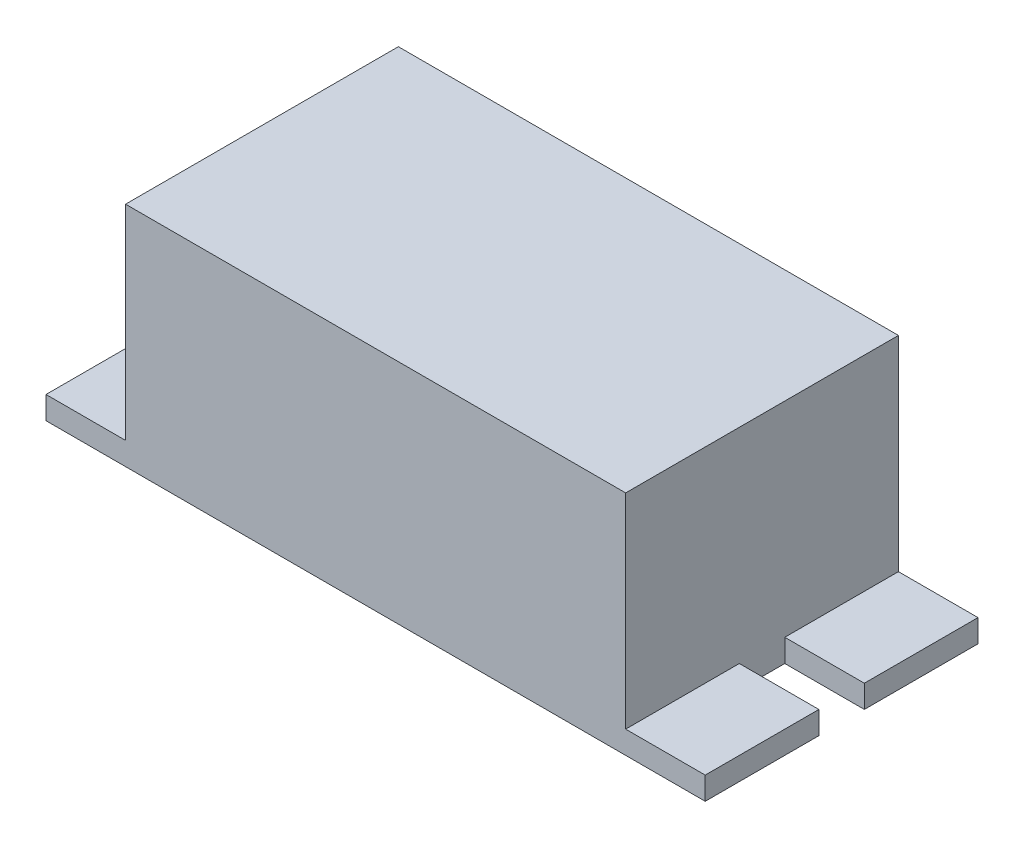
ISO-10303-21;
HEADER;
FILE_DESCRIPTION(('STEP AP214'),'2;1');
FILE_NAME('part.step','',(''),(''),'','','');
FILE_SCHEMA(('AUTOMOTIVE_DESIGN { 1 0 10303 214 1 1 1 1 }'));
ENDSEC;
DATA;
#1=APPLICATION_CONTEXT('core data for automotive mechanical design processes');
#2=APPLICATION_PROTOCOL_DEFINITION('international standard','automotive_design',2000,#1);
#3=PRODUCT_CONTEXT('',#1,'mechanical');
#4=PRODUCT('Part','Part','',(#3));
#5=PRODUCT_RELATED_PRODUCT_CATEGORY('part','',(#4));
#6=PRODUCT_DEFINITION_FORMATION('','',#4);
#7=PRODUCT_DEFINITION_CONTEXT('part definition',#1,'design');
#8=PRODUCT_DEFINITION('design','',#6,#7);
#9=PRODUCT_DEFINITION_SHAPE('','',#8);
#10=(LENGTH_UNIT() NAMED_UNIT(*) SI_UNIT(.MILLI.,.METRE.));
#11=(NAMED_UNIT(*) PLANE_ANGLE_UNIT() SI_UNIT($,.RADIAN.));
#12=(NAMED_UNIT(*) SI_UNIT($,.STERADIAN.) SOLID_ANGLE_UNIT());
#13=UNCERTAINTY_MEASURE_WITH_UNIT(LENGTH_MEASURE(1.E-05),#10,'distance_accuracy_value','');
#14=(GEOMETRIC_REPRESENTATION_CONTEXT(3) GLOBAL_UNCERTAINTY_ASSIGNED_CONTEXT((#13)) GLOBAL_UNIT_ASSIGNED_CONTEXT((#10,
#11,#12)) REPRESENTATION_CONTEXT('',''));
#15=CARTESIAN_POINT('',(0.,0.,0.));
#16=DIRECTION('',(0.,0.,1.));
#17=DIRECTION('',(1.,0.,0.));
#18=AXIS2_PLACEMENT_3D('',#15,#16,#17);
#19=CARTESIAN_POINT('',(-22.,2.,0.));
#20=DIRECTION('',(0.,1.,0.));
#21=DIRECTION('',(0.,0.,1.));
#22=AXIS2_PLACEMENT_3D('',#19,#20,#21);
#23=PLANE('',#22);
#24=DIRECTION('',(-1.,0.,0.));
#25=VECTOR('',#24,1.);
#26=CARTESIAN_POINT('',(0.,2.,-12.));
#27=LINE('',#26,#25);
#28=CARTESIAN_POINT('',(-29.,2.,-12.));
#29=VERTEX_POINT('',#28);
#30=CARTESIAN_POINT('',(-22.,2.,-12.));
#31=VERTEX_POINT('',#30);
#32=EDGE_CURVE('E176',#29,#31,#27,.F.);
#33=ORIENTED_EDGE('',*,*,#32,.F.);
#34=DIRECTION('',(0.,0.,1.));
#35=VECTOR('',#34,1.);
#36=CARTESIAN_POINT('',(-29.,2.,0.));
#37=LINE('',#36,#35);
#38=CARTESIAN_POINT('',(-29.,2.,-2.));
#39=VERTEX_POINT('',#38);
#40=EDGE_CURVE('E183',#39,#29,#37,.F.);
#41=ORIENTED_EDGE('',*,*,#40,.F.);
#42=DIRECTION('',(-1.,0.,0.));
#43=VECTOR('',#42,1.);
#44=CARTESIAN_POINT('',(-22.,2.,-2.00000000000001));
#45=LINE('',#44,#43);
#46=CARTESIAN_POINT('',(-22.,2.,-2.00000000000001));
#47=VERTEX_POINT('',#46);
#48=EDGE_CURVE('E188',#39,#47,#45,.F.);
#49=ORIENTED_EDGE('',*,*,#48,.T.);
#50=DIRECTION('',(0.,0.,1.));
#51=VECTOR('',#50,1.);
#52=CARTESIAN_POINT('',(-22.,2.,0.));
#53=LINE('',#52,#51);
#54=EDGE_CURVE('E125',#31,#47,#53,.T.);
#55=ORIENTED_EDGE('',*,*,#54,.F.);
#56=EDGE_LOOP('',(#33,#41,#49,#55));
#57=FACE_BOUND('',#56,.T.);
#58=ADVANCED_FACE('F16',(#57),#23,.T.);
#59=CARTESIAN_POINT('',(29.,2.,0.));
#60=DIRECTION('',(0.,1.,0.));
#61=DIRECTION('',(0.,0.,1.));
#62=AXIS2_PLACEMENT_3D('',#59,#60,#61);
#63=PLANE('',#62);
#64=DIRECTION('',(-1.,0.,0.));
#65=VECTOR('',#64,1.);
#66=CARTESIAN_POINT('',(0.,2.,-12.));
#67=LINE('',#66,#65);
#68=CARTESIAN_POINT('',(22.,2.,-12.));
#69=VERTEX_POINT('',#68);
#70=CARTESIAN_POINT('',(29.,2.,-12.));
#71=VERTEX_POINT('',#70);
#72=EDGE_CURVE('E171',#69,#71,#67,.F.);
#73=ORIENTED_EDGE('',*,*,#72,.F.);
#74=DIRECTION('',(0.,0.,-1.));
#75=VECTOR('',#74,1.);
#76=CARTESIAN_POINT('',(22.,2.,0.));
#77=LINE('',#76,#75);
#78=CARTESIAN_POINT('',(22.,2.,-2.00000000000001));
#79=VERTEX_POINT('',#78);
#80=EDGE_CURVE('E242',#79,#69,#77,.T.);
#81=ORIENTED_EDGE('',*,*,#80,.F.);
#82=DIRECTION('',(-1.,0.,0.));
#83=VECTOR('',#82,1.);
#84=CARTESIAN_POINT('',(29.,2.,-1.99999999999999));
#85=LINE('',#84,#83);
#86=CARTESIAN_POINT('',(29.,2.,-1.99999999999999));
#87=VERTEX_POINT('',#86);
#88=EDGE_CURVE('E245',#79,#87,#85,.F.);
#89=ORIENTED_EDGE('',*,*,#88,.T.);
#90=DIRECTION('',(0.,0.,1.));
#91=VECTOR('',#90,1.);
#92=CARTESIAN_POINT('',(29.,2.,0.));
#93=LINE('',#92,#91);
#94=EDGE_CURVE('E250',#71,#87,#93,.T.);
#95=ORIENTED_EDGE('',*,*,#94,.F.);
#96=EDGE_LOOP('',(#73,#81,#89,#95));
#97=FACE_BOUND('',#96,.T.);
#98=ADVANCED_FACE('F258',(#97),#63,.T.);
#99=CARTESIAN_POINT('',(29.,2.,0.));
#100=DIRECTION('',(0.,1.,0.));
#101=DIRECTION('',(0.,0.,1.));
#102=AXIS2_PLACEMENT_3D('',#99,#100,#101);
#103=PLANE('',#102);
#104=DIRECTION('',(1.,0.,0.));
#105=VECTOR('',#104,1.);
#106=CARTESIAN_POINT('',(0.,2.,12.));
#107=LINE('',#106,#105);
#108=CARTESIAN_POINT('',(29.,2.,12.));
#109=VERTEX_POINT('',#108);
#110=CARTESIAN_POINT('',(22.,2.,12.));
#111=VERTEX_POINT('',#110);
#112=EDGE_CURVE('E218',#109,#111,#107,.F.);
#113=ORIENTED_EDGE('',*,*,#112,.F.);
#114=DIRECTION('',(0.,0.,1.));
#115=VECTOR('',#114,1.);
#116=CARTESIAN_POINT('',(29.,2.,0.));
#117=LINE('',#116,#115);
#118=CARTESIAN_POINT('',(29.,2.,2.00000000000001));
#119=VERTEX_POINT('',#118);
#120=EDGE_CURVE('E224',#119,#109,#117,.T.);
#121=ORIENTED_EDGE('',*,*,#120,.F.);
#122=DIRECTION('',(1.,0.,0.));
#123=VECTOR('',#122,1.);
#124=CARTESIAN_POINT('',(22.,2.,1.99999999999999));
#125=LINE('',#124,#123);
#126=CARTESIAN_POINT('',(22.,2.,1.99999999999999));
#127=VERTEX_POINT('',#126);
#128=EDGE_CURVE('E229',#119,#127,#125,.F.);
#129=ORIENTED_EDGE('',*,*,#128,.T.);
#130=DIRECTION('',(0.,0.,-1.));
#131=VECTOR('',#130,1.);
#132=CARTESIAN_POINT('',(22.,2.,0.));
#133=LINE('',#132,#131);
#134=EDGE_CURVE('E237',#111,#127,#133,.T.);
#135=ORIENTED_EDGE('',*,*,#134,.F.);
#136=EDGE_LOOP('',(#113,#121,#129,#135));
#137=FACE_BOUND('',#136,.T.);
#138=ADVANCED_FACE('F290',(#137),#103,.T.);
#139=CARTESIAN_POINT('',(22.,20.,0.));
#140=DIRECTION('',(0.,1.,0.));
#141=DIRECTION('',(0.,0.,1.));
#142=AXIS2_PLACEMENT_3D('',#139,#140,#141);
#143=PLANE('',#142);
#144=DIRECTION('',(0.,0.,-1.));
#145=VECTOR('',#144,1.);
#146=CARTESIAN_POINT('',(22.,20.,0.));
#147=LINE('',#146,#145);
#148=CARTESIAN_POINT('',(22.,20.,-12.));
#149=VERTEX_POINT('',#148);
#150=CARTESIAN_POINT('',(22.,20.,12.));
#151=VERTEX_POINT('',#150);
#152=EDGE_CURVE('E167',#149,#151,#147,.F.);
#153=ORIENTED_EDGE('',*,*,#152,.F.);
#154=DIRECTION('',(-1.,0.,0.));
#155=VECTOR('',#154,1.);
#156=CARTESIAN_POINT('',(0.,20.,-12.));
#157=LINE('',#156,#155);
#158=CARTESIAN_POINT('',(-22.,20.,-12.));
#159=VERTEX_POINT('',#158);
#160=EDGE_CURVE('E165',#159,#149,#157,.F.);
#161=ORIENTED_EDGE('',*,*,#160,.F.);
#162=DIRECTION('',(0.,0.,1.));
#163=VECTOR('',#162,1.);
#164=CARTESIAN_POINT('',(-22.,20.,0.));
#165=LINE('',#164,#163);
#166=CARTESIAN_POINT('',(-22.,20.,12.));
#167=VERTEX_POINT('',#166);
#168=EDGE_CURVE('E140',#167,#159,#165,.F.);
#169=ORIENTED_EDGE('',*,*,#168,.F.);
#170=DIRECTION('',(1.,0.,0.));
#171=VECTOR('',#170,1.);
#172=CARTESIAN_POINT('',(0.,20.,12.));
#173=LINE('',#172,#171);
#174=EDGE_CURVE('E213',#151,#167,#173,.F.);
#175=ORIENTED_EDGE('',*,*,#174,.F.);
#176=EDGE_LOOP('',(#153,#161,#169,#175));
#177=FACE_BOUND('',#176,.T.);
#178=ADVANCED_FACE('F166',(#177),#143,.T.);
#179=CARTESIAN_POINT('',(-22.,2.,0.));
#180=DIRECTION('',(0.,1.,0.));
#181=DIRECTION('',(0.,0.,1.));
#182=AXIS2_PLACEMENT_3D('',#179,#180,#181);
#183=PLANE('',#182);
#184=DIRECTION('',(1.,0.,0.));
#185=VECTOR('',#184,1.);
#186=CARTESIAN_POINT('',(0.,2.,12.));
#187=LINE('',#186,#185);
#188=CARTESIAN_POINT('',(-22.,2.,12.));
#189=VERTEX_POINT('',#188);
#190=CARTESIAN_POINT('',(-29.,2.,12.));
#191=VERTEX_POINT('',#190);
#192=EDGE_CURVE('E144',#189,#191,#187,.F.);
#193=ORIENTED_EDGE('',*,*,#192,.F.);
#194=DIRECTION('',(0.,0.,1.));
#195=VECTOR('',#194,1.);
#196=CARTESIAN_POINT('',(-22.,2.,0.));
#197=LINE('',#196,#195);
#198=CARTESIAN_POINT('',(-22.,2.,1.99999999999999));
#199=VERTEX_POINT('',#198);
#200=EDGE_CURVE('E142',#199,#189,#197,.T.);
#201=ORIENTED_EDGE('',*,*,#200,.F.);
#202=DIRECTION('',(1.,0.,0.));
#203=VECTOR('',#202,1.);
#204=CARTESIAN_POINT('',(-29.,2.,2.00000000000001));
#205=LINE('',#204,#203);
#206=CARTESIAN_POINT('',(-29.,2.,2.00000000000001));
#207=VERTEX_POINT('',#206);
#208=EDGE_CURVE('E19',#199,#207,#205,.F.);
#209=ORIENTED_EDGE('',*,*,#208,.T.);
#210=DIRECTION('',(0.,0.,1.));
#211=VECTOR('',#210,1.);
#212=CARTESIAN_POINT('',(-29.,2.,0.));
#213=LINE('',#212,#211);
#214=EDGE_CURVE('E204',#191,#207,#213,.F.);
#215=ORIENTED_EDGE('',*,*,#214,.F.);
#216=EDGE_LOOP('',(#193,#201,#209,#215));
#217=FACE_BOUND('',#216,.T.);
#218=ADVANCED_FACE('F143',(#217),#183,.T.);
#219=CARTESIAN_POINT('',(-29.,0.,2.00000000000001));
#220=DIRECTION('',(0.,0.,1.));
#221=DIRECTION('',(1.,0.,0.));
#222=AXIS2_PLACEMENT_3D('',#219,#220,#221);
#223=PLANE('',#222);
#224=DIRECTION('',(0.,1.,0.));
#225=VECTOR('',#224,1.);
#226=CARTESIAN_POINT('',(-22.,20.,1.99999999999999));
#227=LINE('',#226,#225);
#228=CARTESIAN_POINT('',(-22.,0.,2.));
#229=VERTEX_POINT('',#228);
#230=EDGE_CURVE('E133',#229,#199,#227,.T.);
#231=ORIENTED_EDGE('',*,*,#230,.F.);
#232=DIRECTION('',(1.,0.,0.));
#233=VECTOR('',#232,1.);
#234=CARTESIAN_POINT('',(-29.,0.,2.00000000000001));
#235=LINE('',#234,#233);
#236=CARTESIAN_POINT('',(-29.,0.,2.00000000000001));
#237=VERTEX_POINT('',#236);
#238=EDGE_CURVE('E202',#237,#229,#235,.T.);
#239=ORIENTED_EDGE('',*,*,#238,.F.);
#240=DIRECTION('',(0.,-1.,0.));
#241=VECTOR('',#240,1.);
#242=CARTESIAN_POINT('',(-29.,2.,2.00000000000001));
#243=LINE('',#242,#241);
#244=EDGE_CURVE('E136',#207,#237,#243,.T.);
#245=ORIENTED_EDGE('',*,*,#244,.F.);
#246=ORIENTED_EDGE('',*,*,#208,.F.);
#247=EDGE_LOOP('',(#231,#239,#245,#246));
#248=FACE_BOUND('',#247,.T.);
#249=ADVANCED_FACE('F131',(#248),#223,.F.);
#250=CARTESIAN_POINT('',(-22.,20.,0.));
#251=DIRECTION('',(-1.,0.,0.));
#252=DIRECTION('',(0.,0.,1.));
#253=AXIS2_PLACEMENT_3D('',#250,#251,#252);
#254=PLANE('',#253);
#255=ORIENTED_EDGE('',*,*,#200,.T.);
#256=DIRECTION('',(0.,1.,0.));
#257=VECTOR('',#256,1.);
#258=CARTESIAN_POINT('',(-22.,10.,12.));
#259=LINE('',#258,#257);
#260=EDGE_CURVE('E160',#167,#189,#259,.F.);
#261=ORIENTED_EDGE('',*,*,#260,.F.);
#262=ORIENTED_EDGE('',*,*,#168,.T.);
#263=DIRECTION('',(0.,1.,0.));
#264=VECTOR('',#263,1.);
#265=CARTESIAN_POINT('',(-22.,10.,-12.));
#266=LINE('',#265,#264);
#267=EDGE_CURVE('E158',#31,#159,#266,.T.);
#268=ORIENTED_EDGE('',*,*,#267,.F.);
#269=ORIENTED_EDGE('',*,*,#54,.T.);
#270=DIRECTION('',(0.,1.,0.));
#271=VECTOR('',#270,1.);
#272=CARTESIAN_POINT('',(-22.,0.,-2.00000000000001));
#273=LINE('',#272,#271);
#274=CARTESIAN_POINT('',(-22.,0.,-2.00000000000001));
#275=VERTEX_POINT('',#274);
#276=EDGE_CURVE('E147',#47,#275,#273,.F.);
#277=ORIENTED_EDGE('',*,*,#276,.T.);
#278=DIRECTION('',(0.,0.,-1.));
#279=VECTOR('',#278,1.);
#280=CARTESIAN_POINT('',(-22.,0.,0.));
#281=LINE('',#280,#279);
#282=EDGE_CURVE('E151',#229,#275,#281,.T.);
#283=ORIENTED_EDGE('',*,*,#282,.F.);
#284=ORIENTED_EDGE('',*,*,#230,.T.);
#285=EDGE_LOOP('',(#255,#261,#262,#268,#269,#277,#283,#284));
#286=FACE_BOUND('',#285,.T.);
#287=ADVANCED_FACE('F149',(#286),#254,.T.);
#288=CARTESIAN_POINT('',(-22.,0.,-2.00000000000001));
#289=DIRECTION('',(0.,0.,-1.));
#290=DIRECTION('',(-1.,0.,0.));
#291=AXIS2_PLACEMENT_3D('',#288,#289,#290);
#292=PLANE('',#291);
#293=DIRECTION('',(0.,-1.,0.));
#294=VECTOR('',#293,1.);
#295=CARTESIAN_POINT('',(-29.,2.,-2.));
#296=LINE('',#295,#294);
#297=CARTESIAN_POINT('',(-29.,0.,-2.));
#298=VERTEX_POINT('',#297);
#299=EDGE_CURVE('E185',#298,#39,#296,.F.);
#300=ORIENTED_EDGE('',*,*,#299,.F.);
#301=DIRECTION('',(1.,0.,0.));
#302=VECTOR('',#301,1.);
#303=CARTESIAN_POINT('',(-29.,0.,-2.00000000000001));
#304=LINE('',#303,#302);
#305=EDGE_CURVE('E193',#275,#298,#304,.F.);
#306=ORIENTED_EDGE('',*,*,#305,.F.);
#307=ORIENTED_EDGE('',*,*,#276,.F.);
#308=ORIENTED_EDGE('',*,*,#48,.F.);
#309=EDGE_LOOP('',(#300,#306,#307,#308));
#310=FACE_BOUND('',#309,.T.);
#311=ADVANCED_FACE('F194',(#310),#292,.F.);
#312=CARTESIAN_POINT('',(-29.,2.,0.));
#313=DIRECTION('',(-1.,0.,0.));
#314=DIRECTION('',(0.,-1.,0.));
#315=AXIS2_PLACEMENT_3D('',#312,#313,#314);
#316=PLANE('',#315);
#317=DIRECTION('',(0.,1.,0.));
#318=VECTOR('',#317,1.);
#319=CARTESIAN_POINT('',(-29.,10.,-12.));
#320=LINE('',#319,#318);
#321=CARTESIAN_POINT('',(-29.,0.,-12.));
#322=VERTEX_POINT('',#321);
#323=EDGE_CURVE('E178',#322,#29,#320,.T.);
#324=ORIENTED_EDGE('',*,*,#323,.F.);
#325=DIRECTION('',(0.,0.,-1.));
#326=VECTOR('',#325,1.);
#327=CARTESIAN_POINT('',(-29.,0.,0.));
#328=LINE('',#327,#326);
#329=EDGE_CURVE('E198',#298,#322,#328,.T.);
#330=ORIENTED_EDGE('',*,*,#329,.F.);
#331=ORIENTED_EDGE('',*,*,#299,.T.);
#332=ORIENTED_EDGE('',*,*,#40,.T.);
#333=EDGE_LOOP('',(#324,#330,#331,#332));
#334=FACE_BOUND('',#333,.T.);
#335=ADVANCED_FACE('F324',(#334),#316,.T.);
#336=CARTESIAN_POINT('',(0.,10.,-12.));
#337=DIRECTION('',(0.,0.,-1.));
#338=DIRECTION('',(-1.,0.,0.));
#339=AXIS2_PLACEMENT_3D('',#336,#337,#338);
#340=PLANE('',#339);
#341=ORIENTED_EDGE('',*,*,#72,.T.);
#342=DIRECTION('',(0.,1.,0.));
#343=VECTOR('',#342,1.);
#344=CARTESIAN_POINT('',(29.,0.,-12.));
#345=LINE('',#344,#343);
#346=CARTESIAN_POINT('',(29.,0.,-12.));
#347=VERTEX_POINT('',#346);
#348=EDGE_CURVE('E252',#347,#71,#345,.T.);
#349=ORIENTED_EDGE('',*,*,#348,.F.);
#350=DIRECTION('',(1.,0.,0.));
#351=VECTOR('',#350,1.);
#352=CARTESIAN_POINT('',(-29.,0.,-12.));
#353=LINE('',#352,#351);
#354=EDGE_CURVE('E269',#322,#347,#353,.T.);
#355=ORIENTED_EDGE('',*,*,#354,.F.);
#356=ORIENTED_EDGE('',*,*,#323,.T.);
#357=ORIENTED_EDGE('',*,*,#32,.T.);
#358=ORIENTED_EDGE('',*,*,#267,.T.);
#359=ORIENTED_EDGE('',*,*,#160,.T.);
#360=DIRECTION('',(0.,1.,0.));
#361=VECTOR('',#360,1.);
#362=CARTESIAN_POINT('',(22.,2.,-12.));
#363=LINE('',#362,#361);
#364=EDGE_CURVE('E240',#69,#149,#363,.T.);
#365=ORIENTED_EDGE('',*,*,#364,.F.);
#366=EDGE_LOOP('',(#341,#349,#355,#356,#357,#358,#359,#365));
#367=FACE_BOUND('',#366,.T.);
#368=ADVANCED_FACE('F173',(#367),#340,.T.);
#369=CARTESIAN_POINT('',(29.,0.,0.));
#370=DIRECTION('',(1.,0.,0.));
#371=DIRECTION('',(0.,1.,0.));
#372=AXIS2_PLACEMENT_3D('',#369,#370,#371);
#373=PLANE('',#372);
#374=ORIENTED_EDGE('',*,*,#348,.T.);
#375=ORIENTED_EDGE('',*,*,#94,.T.);
#376=DIRECTION('',(0.,1.,0.));
#377=VECTOR('',#376,1.);
#378=CARTESIAN_POINT('',(29.,0.,-1.99999999999999));
#379=LINE('',#378,#377);
#380=CARTESIAN_POINT('',(29.,0.,-1.99999999999999));
#381=VERTEX_POINT('',#380);
#382=EDGE_CURVE('E248',#87,#381,#379,.F.);
#383=ORIENTED_EDGE('',*,*,#382,.T.);
#384=DIRECTION('',(0.,0.,-1.));
#385=VECTOR('',#384,1.);
#386=CARTESIAN_POINT('',(29.,0.,0.));
#387=LINE('',#386,#385);
#388=EDGE_CURVE('E264',#347,#381,#387,.F.);
#389=ORIENTED_EDGE('',*,*,#388,.F.);
#390=EDGE_LOOP('',(#374,#375,#383,#389));
#391=FACE_BOUND('',#390,.T.);
#392=ADVANCED_FACE('F262',(#391),#373,.T.);
#393=CARTESIAN_POINT('',(29.,0.,-1.99999999999999));
#394=DIRECTION('',(0.,0.,-1.));
#395=DIRECTION('',(-1.,0.,0.));
#396=AXIS2_PLACEMENT_3D('',#393,#394,#395);
#397=PLANE('',#396);
#398=DIRECTION('',(0.,1.,0.));
#399=VECTOR('',#398,1.);
#400=CARTESIAN_POINT('',(22.,2.,-2.00000000000001));
#401=LINE('',#400,#399);
#402=CARTESIAN_POINT('',(22.,0.,-2.00000000000001));
#403=VERTEX_POINT('',#402);
#404=EDGE_CURVE('E234',#403,#79,#401,.T.);
#405=ORIENTED_EDGE('',*,*,#404,.F.);
#406=DIRECTION('',(1.,0.,0.));
#407=VECTOR('',#406,1.);
#408=CARTESIAN_POINT('',(-29.,0.,-1.99999999999999));
#409=LINE('',#408,#407);
#410=EDGE_CURVE('E268',#381,#403,#409,.F.);
#411=ORIENTED_EDGE('',*,*,#410,.F.);
#412=ORIENTED_EDGE('',*,*,#382,.F.);
#413=ORIENTED_EDGE('',*,*,#88,.F.);
#414=EDGE_LOOP('',(#405,#411,#412,#413));
#415=FACE_BOUND('',#414,.T.);
#416=ADVANCED_FACE('F316',(#415),#397,.F.);
#417=CARTESIAN_POINT('',(22.,2.,0.));
#418=DIRECTION('',(1.,0.,0.));
#419=DIRECTION('',(0.,0.,-1.));
#420=AXIS2_PLACEMENT_3D('',#417,#418,#419);
#421=PLANE('',#420);
#422=DIRECTION('',(0.,0.,-1.));
#423=VECTOR('',#422,1.);
#424=CARTESIAN_POINT('',(22.,0.,0.));
#425=LINE('',#424,#423);
#426=CARTESIAN_POINT('',(22.,0.,1.99999999999999));
#427=VERTEX_POINT('',#426);
#428=EDGE_CURVE('E274',#403,#427,#425,.F.);
#429=ORIENTED_EDGE('',*,*,#428,.F.);
#430=ORIENTED_EDGE('',*,*,#404,.T.);
#431=ORIENTED_EDGE('',*,*,#80,.T.);
#432=ORIENTED_EDGE('',*,*,#364,.T.);
#433=ORIENTED_EDGE('',*,*,#152,.T.);
#434=DIRECTION('',(0.,1.,0.));
#435=VECTOR('',#434,1.);
#436=CARTESIAN_POINT('',(22.,10.,12.));
#437=LINE('',#436,#435);
#438=EDGE_CURVE('E215',#111,#151,#437,.T.);
#439=ORIENTED_EDGE('',*,*,#438,.F.);
#440=ORIENTED_EDGE('',*,*,#134,.T.);
#441=DIRECTION('',(0.,1.,0.));
#442=VECTOR('',#441,1.);
#443=CARTESIAN_POINT('',(22.,0.,1.99999999999999));
#444=LINE('',#443,#442);
#445=EDGE_CURVE('E232',#127,#427,#444,.F.);
#446=ORIENTED_EDGE('',*,*,#445,.T.);
#447=EDGE_LOOP('',(#429,#430,#431,#432,#433,#439,#440,#446));
#448=FACE_BOUND('',#447,.T.);
#449=ADVANCED_FACE('F295',(#448),#421,.T.);
#450=CARTESIAN_POINT('',(22.,0.,1.99999999999999));
#451=DIRECTION('',(0.,0.,1.));
#452=DIRECTION('',(1.,0.,0.));
#453=AXIS2_PLACEMENT_3D('',#450,#451,#452);
#454=PLANE('',#453);
#455=DIRECTION('',(0.,1.,0.));
#456=VECTOR('',#455,1.);
#457=CARTESIAN_POINT('',(29.,0.,2.00000000000001));
#458=LINE('',#457,#456);
#459=CARTESIAN_POINT('',(29.,0.,2.));
#460=VERTEX_POINT('',#459);
#461=EDGE_CURVE('E226',#460,#119,#458,.T.);
#462=ORIENTED_EDGE('',*,*,#461,.F.);
#463=DIRECTION('',(1.,0.,0.));
#464=VECTOR('',#463,1.);
#465=CARTESIAN_POINT('',(-29.,0.,1.99999999999999));
#466=LINE('',#465,#464);
#467=EDGE_CURVE('E277',#427,#460,#466,.T.);
#468=ORIENTED_EDGE('',*,*,#467,.F.);
#469=ORIENTED_EDGE('',*,*,#445,.F.);
#470=ORIENTED_EDGE('',*,*,#128,.F.);
#471=EDGE_LOOP('',(#462,#468,#469,#470));
#472=FACE_BOUND('',#471,.T.);
#473=ADVANCED_FACE('F310',(#472),#454,.F.);
#474=CARTESIAN_POINT('',(29.,0.,0.));
#475=DIRECTION('',(1.,0.,0.));
#476=DIRECTION('',(0.,1.,0.));
#477=AXIS2_PLACEMENT_3D('',#474,#475,#476);
#478=PLANE('',#477);
#479=DIRECTION('',(0.,1.,0.));
#480=VECTOR('',#479,1.);
#481=CARTESIAN_POINT('',(29.,10.,12.));
#482=LINE('',#481,#480);
#483=CARTESIAN_POINT('',(29.,0.,12.));
#484=VERTEX_POINT('',#483);
#485=EDGE_CURVE('E221',#484,#109,#482,.T.);
#486=ORIENTED_EDGE('',*,*,#485,.F.);
#487=DIRECTION('',(0.,0.,-1.));
#488=VECTOR('',#487,1.);
#489=CARTESIAN_POINT('',(29.,0.,0.));
#490=LINE('',#489,#488);
#491=EDGE_CURVE('E280',#460,#484,#490,.F.);
#492=ORIENTED_EDGE('',*,*,#491,.F.);
#493=ORIENTED_EDGE('',*,*,#461,.T.);
#494=ORIENTED_EDGE('',*,*,#120,.T.);
#495=EDGE_LOOP('',(#486,#492,#493,#494));
#496=FACE_BOUND('',#495,.T.);
#497=ADVANCED_FACE('F287',(#496),#478,.T.);
#498=CARTESIAN_POINT('',(0.,10.,12.));
#499=DIRECTION('',(0.,0.,1.));
#500=DIRECTION('',(1.,0.,0.));
#501=AXIS2_PLACEMENT_3D('',#498,#499,#500);
#502=PLANE('',#501);
#503=ORIENTED_EDGE('',*,*,#192,.T.);
#504=DIRECTION('',(0.,-1.,0.));
#505=VECTOR('',#504,1.);
#506=CARTESIAN_POINT('',(-29.,2.,12.));
#507=LINE('',#506,#505);
#508=CARTESIAN_POINT('',(-29.,0.,12.));
#509=VERTEX_POINT('',#508);
#510=EDGE_CURVE('E34',#509,#191,#507,.F.);
#511=ORIENTED_EDGE('',*,*,#510,.F.);
#512=DIRECTION('',(1.,0.,0.));
#513=VECTOR('',#512,1.);
#514=CARTESIAN_POINT('',(-29.,0.,12.));
#515=LINE('',#514,#513);
#516=EDGE_CURVE('E25',#484,#509,#515,.F.);
#517=ORIENTED_EDGE('',*,*,#516,.F.);
#518=ORIENTED_EDGE('',*,*,#485,.T.);
#519=ORIENTED_EDGE('',*,*,#112,.T.);
#520=ORIENTED_EDGE('',*,*,#438,.T.);
#521=ORIENTED_EDGE('',*,*,#174,.T.);
#522=ORIENTED_EDGE('',*,*,#260,.T.);
#523=EDGE_LOOP('',(#503,#511,#517,#518,#519,#520,#521,#522));
#524=FACE_BOUND('',#523,.T.);
#525=ADVANCED_FACE('F284',(#524),#502,.T.);
#526=CARTESIAN_POINT('',(-29.,2.,0.));
#527=DIRECTION('',(-1.,0.,0.));
#528=DIRECTION('',(0.,-1.,0.));
#529=AXIS2_PLACEMENT_3D('',#526,#527,#528);
#530=PLANE('',#529);
#531=ORIENTED_EDGE('',*,*,#510,.T.);
#532=ORIENTED_EDGE('',*,*,#214,.T.);
#533=ORIENTED_EDGE('',*,*,#244,.T.);
#534=DIRECTION('',(0.,0.,-1.));
#535=VECTOR('',#534,1.);
#536=CARTESIAN_POINT('',(-29.,0.,0.));
#537=LINE('',#536,#535);
#538=EDGE_CURVE('E11',#509,#237,#537,.T.);
#539=ORIENTED_EDGE('',*,*,#538,.F.);
#540=EDGE_LOOP('',(#531,#532,#533,#539));
#541=FACE_BOUND('',#540,.T.);
#542=ADVANCED_FACE('F297',(#541),#530,.T.);
#543=CARTESIAN_POINT('',(-29.,0.,0.));
#544=DIRECTION('',(0.,-1.,0.));
#545=DIRECTION('',(0.,0.,-1.));
#546=AXIS2_PLACEMENT_3D('',#543,#544,#545);
#547=PLANE('',#546);
#548=ORIENTED_EDGE('',*,*,#516,.T.);
#549=ORIENTED_EDGE('',*,*,#538,.T.);
#550=ORIENTED_EDGE('',*,*,#238,.T.);
#551=ORIENTED_EDGE('',*,*,#282,.T.);
#552=ORIENTED_EDGE('',*,*,#305,.T.);
#553=ORIENTED_EDGE('',*,*,#329,.T.);
#554=ORIENTED_EDGE('',*,*,#354,.T.);
#555=ORIENTED_EDGE('',*,*,#388,.T.);
#556=ORIENTED_EDGE('',*,*,#410,.T.);
#557=ORIENTED_EDGE('',*,*,#428,.T.);
#558=ORIENTED_EDGE('',*,*,#467,.T.);
#559=ORIENTED_EDGE('',*,*,#491,.T.);
#560=EDGE_LOOP('',(#548,#549,#550,#551,#552,#553,#554,#555,#556,#557,#558,#559));
#561=FACE_BOUND('',#560,.T.);
#562=ADVANCED_FACE('F201',(#561),#547,.T.);
#563=CLOSED_SHELL('',(#58,#98,#138,#178,#218,#249,#287,#311,#335,#368,#392,#416,#449,#473,#497,
#525,#542,#562));
#564=MANIFOLD_SOLID_BREP('B1',#563);
#565=ADVANCED_BREP_SHAPE_REPRESENTATION('',(#18,#564),#14);
#566=SHAPE_DEFINITION_REPRESENTATION(#9,#565);
ENDSEC;
END-ISO-10303-21;
